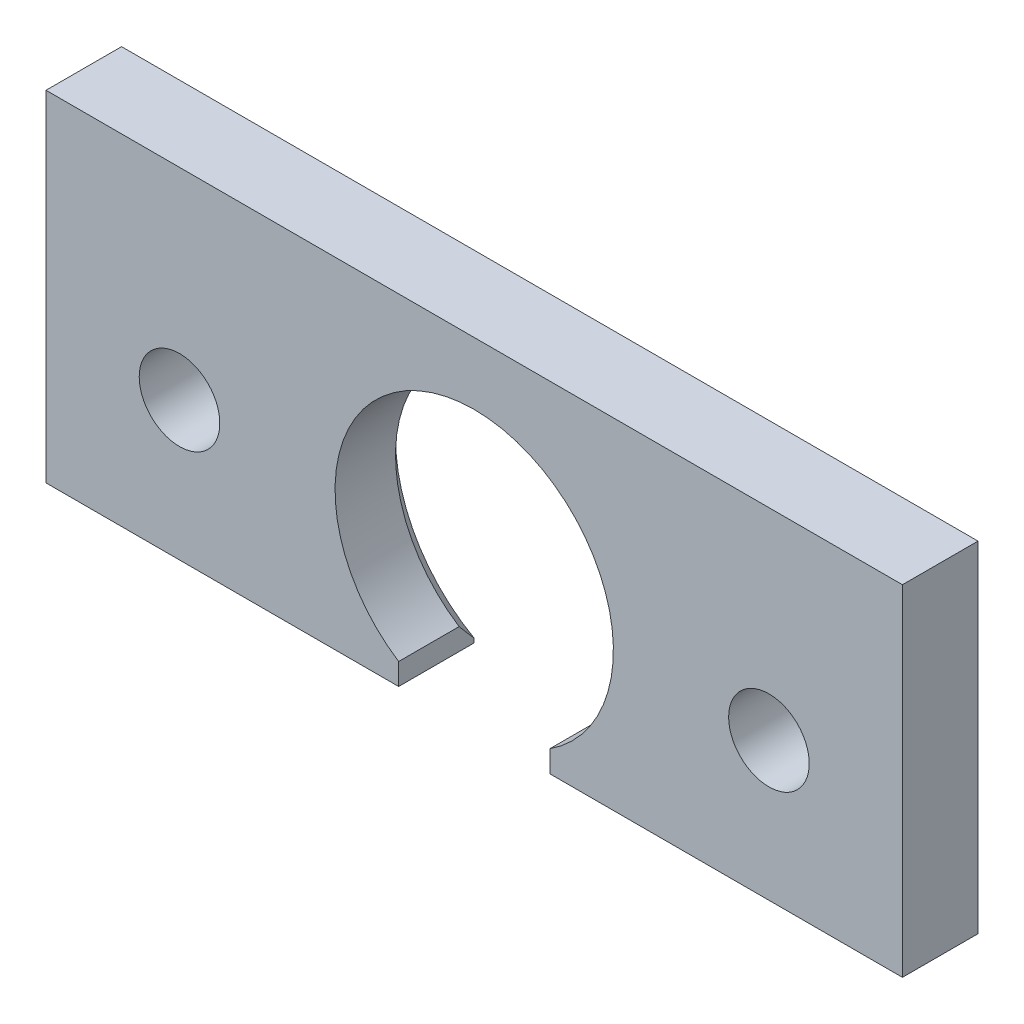
ISO-10303-21;
HEADER;
FILE_DESCRIPTION(('STEP AP214'),'2;1');
FILE_NAME('part.step','',(''),(''),'','','');
FILE_SCHEMA(('AUTOMOTIVE_DESIGN { 1 0 10303 214 1 1 1 1 }'));
ENDSEC;
DATA;
#1=APPLICATION_CONTEXT('core data for automotive mechanical design processes');
#2=APPLICATION_PROTOCOL_DEFINITION('international standard','automotive_design',2000,#1);
#3=PRODUCT_CONTEXT('',#1,'mechanical');
#4=PRODUCT('Part','Part','',(#3));
#5=PRODUCT_RELATED_PRODUCT_CATEGORY('part','',(#4));
#6=PRODUCT_DEFINITION_FORMATION('','',#4);
#7=PRODUCT_DEFINITION_CONTEXT('part definition',#1,'design');
#8=PRODUCT_DEFINITION('design','',#6,#7);
#9=PRODUCT_DEFINITION_SHAPE('','',#8);
#10=(LENGTH_UNIT() NAMED_UNIT(*) SI_UNIT(.MILLI.,.METRE.));
#11=(NAMED_UNIT(*) PLANE_ANGLE_UNIT() SI_UNIT($,.RADIAN.));
#12=(NAMED_UNIT(*) SI_UNIT($,.STERADIAN.) SOLID_ANGLE_UNIT());
#13=UNCERTAINTY_MEASURE_WITH_UNIT(LENGTH_MEASURE(1.E-05),#10,'distance_accuracy_value','');
#14=(GEOMETRIC_REPRESENTATION_CONTEXT(3) GLOBAL_UNCERTAINTY_ASSIGNED_CONTEXT((#13)) GLOBAL_UNIT_ASSIGNED_CONTEXT((#10,
#11,#12)) REPRESENTATION_CONTEXT('',''));
#15=CARTESIAN_POINT('',(0.,0.,0.));
#16=DIRECTION('',(0.,0.,1.));
#17=DIRECTION('',(1.,0.,0.));
#18=AXIS2_PLACEMENT_3D('',#15,#16,#17);
#19=CARTESIAN_POINT('',(-85.,40.0000000000002,14.9999999999989));
#20=DIRECTION('',(0.,0.999999999999998,0.));
#21=DIRECTION('',(0.,0.,1.00000000000002));
#22=AXIS2_PLACEMENT_3D('',#19,#20,#21);
#23=PLANE('',#22);
#24=DIRECTION('',(0.999999999999998,0.,0.));
#25=VECTOR('',#24,1.);
#26=CARTESIAN_POINT('',(-84.9999999999998,40.0000000000004,1.11022302462516E-12));
#27=LINE('',#26,#25);
#28=CARTESIAN_POINT('',(-84.9999999999998,40.0000000000004,1.11022302462516E-12));
#29=VERTEX_POINT('',#28);
#30=CARTESIAN_POINT('',(84.9999999999997,40.0000000000003,-3.33066907387547E-13));
#31=VERTEX_POINT('',#30);
#32=EDGE_CURVE('E134',#29,#31,#27,.T.);
#33=ORIENTED_EDGE('',*,*,#32,.F.);
#34=DIRECTION('',(0.,0.,-1.00000000000002));
#35=VECTOR('',#34,1.);
#36=CARTESIAN_POINT('',(-85.,40.0000000000002,14.9999999999989));
#37=LINE('',#36,#35);
#38=CARTESIAN_POINT('',(-85.,40.0000000000002,14.9999999999989));
#39=VERTEX_POINT('',#38);
#40=EDGE_CURVE('E202',#39,#29,#37,.T.);
#41=ORIENTED_EDGE('',*,*,#40,.F.);
#42=DIRECTION('',(0.999999999999998,0.,0.));
#43=VECTOR('',#42,1.);
#44=CARTESIAN_POINT('',(-85.,40.0000000000002,14.9999999999989));
#45=LINE('',#44,#43);
#46=CARTESIAN_POINT('',(84.9999999999999,40.,15.0000000000005));
#47=VERTEX_POINT('',#46);
#48=EDGE_CURVE('E144',#39,#47,#45,.T.);
#49=ORIENTED_EDGE('',*,*,#48,.T.);
#50=DIRECTION('',(0.,0.,-1.00000000000002));
#51=VECTOR('',#50,1.);
#52=CARTESIAN_POINT('',(84.9999999999999,40.,15.0000000000005));
#53=LINE('',#52,#51);
#54=EDGE_CURVE('E127',#47,#31,#53,.T.);
#55=ORIENTED_EDGE('',*,*,#54,.T.);
#56=EDGE_LOOP('',(#33,#41,#49,#55));
#57=FACE_BOUND('',#56,.T.);
#58=ADVANCED_FACE('F46',(#57),#23,.T.);
#59=CARTESIAN_POINT('',(-85.0000000000002,27.5000000000001,14.9999999999995));
#60=DIRECTION('',(-0.999999999999998,0.,0.));
#61=DIRECTION('',(0.,0.,1.00000000000002));
#62=AXIS2_PLACEMENT_3D('',#59,#60,#61);
#63=PLANE('',#62);
#64=DIRECTION('',(0.,0.999999999999998,0.));
#65=VECTOR('',#64,1.);
#66=CARTESIAN_POINT('',(-84.9999999999997,27.5000000000004,1.11022302462516E-12));
#67=LINE('',#66,#65);
#68=CARTESIAN_POINT('',(-85.,-27.4999999999998,1.22124532708767E-12));
#69=VERTEX_POINT('',#68);
#70=EDGE_CURVE('E192',#69,#29,#67,.T.);
#71=ORIENTED_EDGE('',*,*,#70,.F.);
#72=DIRECTION('',(0.,0.,-1.00000000000002));
#73=VECTOR('',#72,1.);
#74=CARTESIAN_POINT('',(-84.9999999999999,-27.4999999999996,14.9999999999985));
#75=LINE('',#74,#73);
#76=CARTESIAN_POINT('',(-84.9999999999999,-27.4999999999996,14.9999999999985));
#77=VERTEX_POINT('',#76);
#78=EDGE_CURVE('E205',#77,#69,#75,.T.);
#79=ORIENTED_EDGE('',*,*,#78,.F.);
#80=DIRECTION('',(0.,0.999999999999998,0.));
#81=VECTOR('',#80,1.);
#82=CARTESIAN_POINT('',(-85.0000000000002,27.5000000000001,14.9999999999995));
#83=LINE('',#82,#81);
#84=EDGE_CURVE('E170',#77,#39,#83,.T.);
#85=ORIENTED_EDGE('',*,*,#84,.T.);
#86=ORIENTED_EDGE('',*,*,#40,.T.);
#87=EDGE_LOOP('',(#71,#79,#85,#86));
#88=FACE_BOUND('',#87,.T.);
#89=ADVANCED_FACE('F253',(#88),#63,.T.);
#90=CARTESIAN_POINT('',(-14.9999999999998,-27.4999999999993,15.0000000000023));
#91=DIRECTION('',(0.,-0.999999999999999,0.));
#92=DIRECTION('',(0.999999999999998,0.,0.));
#93=AXIS2_PLACEMENT_3D('',#90,#91,#92);
#94=PLANE('',#93);
#95=DIRECTION('',(-0.999999999999998,0.,0.));
#96=VECTOR('',#95,1.);
#97=CARTESIAN_POINT('',(-15.,-27.4999999999989,3.33066907387547E-13));
#98=LINE('',#97,#96);
#99=CARTESIAN_POINT('',(-15.,-27.4999999999989,3.33066907387547E-13));
#100=VERTEX_POINT('',#99);
#101=EDGE_CURVE('E188',#100,#69,#98,.T.);
#102=ORIENTED_EDGE('',*,*,#101,.F.);
#103=DIRECTION('',(0.,0.,-1.00000000000002));
#104=VECTOR('',#103,1.);
#105=CARTESIAN_POINT('',(-14.9999999999998,-27.4999999999993,15.0000000000023));
#106=LINE('',#105,#104);
#107=CARTESIAN_POINT('',(-14.9999999999998,-27.4999999999993,15.0000000000023));
#108=VERTEX_POINT('',#107);
#109=EDGE_CURVE('E209',#108,#100,#106,.T.);
#110=ORIENTED_EDGE('',*,*,#109,.F.);
#111=DIRECTION('',(-0.999999999999998,0.,0.));
#112=VECTOR('',#111,1.);
#113=CARTESIAN_POINT('',(-14.9999999999998,-27.4999999999993,15.0000000000023));
#114=LINE('',#113,#112);
#115=EDGE_CURVE('E166',#108,#77,#114,.T.);
#116=ORIENTED_EDGE('',*,*,#115,.T.);
#117=ORIENTED_EDGE('',*,*,#78,.T.);
#118=EDGE_LOOP('',(#102,#110,#116,#117));
#119=FACE_BOUND('',#118,.T.);
#120=ADVANCED_FACE('F236',(#119),#94,.T.);
#121=CARTESIAN_POINT('',(-14.9999999999999,-23.1978581985487,15.0000000000018));
#122=DIRECTION('',(0.999999999999998,0.,0.));
#123=DIRECTION('',(0.,0.,-1.00000000000002));
#124=AXIS2_PLACEMENT_3D('',#121,#122,#123);
#125=PLANE('',#124);
#126=DIRECTION('',(0.,-0.999999999999998,0.));
#127=VECTOR('',#126,1.);
#128=CARTESIAN_POINT('',(-14.9999999999998,-23.1978581985485,5.55111512312578E-13));
#129=LINE('',#128,#127);
#130=CARTESIAN_POINT('',(-15.0000000000001,-26.7000117041166,7.7715611723761E-13));
#131=VERTEX_POINT('',#130);
#132=EDGE_CURVE('E185',#131,#100,#129,.T.);
#133=ORIENTED_EDGE('',*,*,#132,.F.);
#134=CARTESIAN_POINT('',(-15.0000000000001,-26.7000117041166,7.7715611723761E-13));
#135=CARTESIAN_POINT('',(-15.,-26.4103468358162,0.252537156596025));
#136=CARTESIAN_POINT('',(-14.9999999999999,-26.120196547771,0.504518436839914));
#137=CARTESIAN_POINT('',(-14.9999999999999,-25.5388424364599,1.00725001289121));
#138=CARTESIAN_POINT('',(-14.9999999999999,-25.247638635797,1.25800033483994));
#139=CARTESIAN_POINT('',(-14.9999999999999,-24.6640815369736,1.75816233148518));
#140=CARTESIAN_POINT('',(-14.9999999999999,-24.3717282352016,2.00757400196996));
#141=CARTESIAN_POINT('',(-14.9999999999999,-23.785762308893,2.50492609294541));
#142=CARTESIAN_POINT('',(-14.9999999999999,-23.4921496576188,2.7528664819299));
#143=CARTESIAN_POINT('',(-15.,-23.1978581985486,3.00000000000011));
#144=B_SPLINE_CURVE_WITH_KNOTS('',3,(#134,#135,#136,#137,#138,#139,#140,#141,#142,#143),
.UNSPECIFIED.,.F.,.F.,(4,2,2,2,4),(0.,1.15287774819484,2.30573090638448,3.45858768960279,
4.61146907176898),.UNSPECIFIED.);
#145=CARTESIAN_POINT('',(-15.,-23.1978581985486,3.00000000000011));
#146=VERTEX_POINT('',#145);
#147=EDGE_CURVE('E75',#131,#146,#144,.T.);
#148=ORIENTED_EDGE('',*,*,#147,.T.);
#149=DIRECTION('',(0.,0.,-1.00000000000002));
#150=VECTOR('',#149,1.);
#151=CARTESIAN_POINT('',(-14.9999999999999,-23.1978581985487,15.0000000000018));
#152=LINE('',#151,#150);
#153=CARTESIAN_POINT('',(-14.9999999999999,-23.1978581985487,15.0000000000018));
#154=VERTEX_POINT('',#153);
#155=EDGE_CURVE('E213',#154,#146,#152,.T.);
#156=ORIENTED_EDGE('',*,*,#155,.F.);
#157=DIRECTION('',(0.,-0.999999999999998,0.));
#158=VECTOR('',#157,1.);
#159=CARTESIAN_POINT('',(-14.9999999999999,-23.1978581985487,15.0000000000018));
#160=LINE('',#159,#158);
#161=EDGE_CURVE('E162',#154,#108,#160,.T.);
#162=ORIENTED_EDGE('',*,*,#161,.T.);
#163=ORIENTED_EDGE('',*,*,#109,.T.);
#164=EDGE_LOOP('',(#133,#148,#156,#162,#163));
#165=FACE_BOUND('',#164,.T.);
#166=ADVANCED_FACE('F230',(#165),#125,.T.);
#167=CARTESIAN_POINT('',(1.11022302462516E-13,4.44089209850063E-13,14.9999999999999));
#168=DIRECTION('',(0.,0.,-1.00000000000002));
#169=DIRECTION('',(-0.999999999999998,0.,0.));
#170=AXIS2_PLACEMENT_3D('',#167,#168,#169);
#171=CYLINDRICAL_SURFACE('',#170,27.625);
#172=ORIENTED_EDGE('',*,*,#155,.T.);
#173=CARTESIAN_POINT('',(0.,0.,2.99999999999989));
#174=DIRECTION('',(0.,0.,-1.00000000000002));
#175=DIRECTION('',(-0.999999999999998,0.,0.));
#176=AXIS2_PLACEMENT_3D('',#173,#174,#175);
#177=CIRCLE('',#176,27.625);
#178=CARTESIAN_POINT('',(14.9999999999999,-23.1978581985488,2.99999999999812));
#179=VERTEX_POINT('',#178);
#180=EDGE_CURVE('E61',#146,#179,#177,.T.);
#181=ORIENTED_EDGE('',*,*,#180,.T.);
#182=DIRECTION('',(0.,0.,-1.00000000000002));
#183=VECTOR('',#182,1.);
#184=CARTESIAN_POINT('',(15.0000000000002,-23.1978581985486,15.0000000000002));
#185=LINE('',#184,#183);
#186=CARTESIAN_POINT('',(15.0000000000002,-23.1978581985486,15.0000000000002));
#187=VERTEX_POINT('',#186);
#188=EDGE_CURVE('E216',#187,#179,#185,.T.);
#189=ORIENTED_EDGE('',*,*,#188,.F.);
#190=CARTESIAN_POINT('',(1.11022302462516E-13,4.44089209850063E-13,14.9999999999999));
#191=DIRECTION('',(0.,0.,1.00000000000002));
#192=DIRECTION('',(-0.999999999999998,0.,0.));
#193=AXIS2_PLACEMENT_3D('',#190,#191,#192);
#194=CIRCLE('',#193,27.625);
#195=EDGE_CURVE('E155',#187,#154,#194,.T.);
#196=ORIENTED_EDGE('',*,*,#195,.T.);
#197=EDGE_LOOP('',(#172,#181,#189,#196));
#198=FACE_BOUND('',#197,.T.);
#199=ADVANCED_FACE('F235',(#198),#171,.F.);
#200=CARTESIAN_POINT('',(15.0000000000002,-23.1978581985486,15.0000000000002));
#201=DIRECTION('',(-0.999999999999998,0.,0.));
#202=DIRECTION('',(0.,0.,1.00000000000002));
#203=AXIS2_PLACEMENT_3D('',#200,#201,#202);
#204=PLANE('',#203);
#205=ORIENTED_EDGE('',*,*,#188,.T.);
#206=CARTESIAN_POINT('',(14.9999999999999,-23.1978581985488,2.99999999999812));
#207=CARTESIAN_POINT('',(15.0000000000001,-23.4921496576195,2.75286648192854));
#208=CARTESIAN_POINT('',(15.0000000000002,-23.785762308894,2.50492609294425));
#209=CARTESIAN_POINT('',(15.0000000000003,-24.3717282352028,2.00757400196888));
#210=CARTESIAN_POINT('',(15.0000000000002,-24.6640815369748,1.75816233148398));
#211=CARTESIAN_POINT('',(15.0000000000002,-25.2476386357982,1.25800033483872));
#212=CARTESIAN_POINT('',(15.0000000000003,-25.5388424364613,1.00725001289009));
#213=CARTESIAN_POINT('',(15.0000000000002,-26.1201965477722,0.504518436838422));
#214=CARTESIAN_POINT('',(15.0000000000001,-26.410346835817,0.252537156594064));
#215=CARTESIAN_POINT('',(14.9999999999998,-26.7000117041165,-2.33146835171283E-12));
#216=B_SPLINE_CURVE_WITH_KNOTS('',3,(#206,#207,#208,#209,#210,#211,#212,#213,#214,#215),
.UNSPECIFIED.,.F.,.F.,(4,2,2,2,4),(0.,1.15288138216634,2.30573816538479,3.45859132357457,
4.61146907176956),.UNSPECIFIED.);
#217=CARTESIAN_POINT('',(14.9999999999998,-26.7000117041165,-2.33146835171283E-12));
#218=VERTEX_POINT('',#217);
#219=EDGE_CURVE('E11',#179,#218,#216,.T.);
#220=ORIENTED_EDGE('',*,*,#219,.T.);
#221=DIRECTION('',(0.,0.999999999999998,0.));
#222=VECTOR('',#221,1.);
#223=CARTESIAN_POINT('',(15.,-23.1978581985486,-2.44249065417534E-12));
#224=LINE('',#223,#222);
#225=CARTESIAN_POINT('',(15.,-27.4999999999994,-2.55351295663786E-12));
#226=VERTEX_POINT('',#225);
#227=EDGE_CURVE('E181',#226,#218,#224,.T.);
#228=ORIENTED_EDGE('',*,*,#227,.F.);
#229=DIRECTION('',(0.,0.,-1.00000000000002));
#230=VECTOR('',#229,1.);
#231=CARTESIAN_POINT('',(15.0000000000002,-27.4999999999993,15.0000000000002));
#232=LINE('',#231,#230);
#233=CARTESIAN_POINT('',(15.0000000000002,-27.4999999999993,15.0000000000002));
#234=VERTEX_POINT('',#233);
#235=EDGE_CURVE('E143',#234,#226,#232,.T.);
#236=ORIENTED_EDGE('',*,*,#235,.F.);
#237=DIRECTION('',(0.,0.999999999999998,0.));
#238=VECTOR('',#237,1.);
#239=CARTESIAN_POINT('',(15.0000000000002,-23.1978581985486,15.0000000000002));
#240=LINE('',#239,#238);
#241=EDGE_CURVE('E150',#234,#187,#240,.T.);
#242=ORIENTED_EDGE('',*,*,#241,.T.);
#243=EDGE_LOOP('',(#205,#220,#228,#236,#242));
#244=FACE_BOUND('',#243,.T.);
#245=ADVANCED_FACE('F239',(#244),#204,.T.);
#246=CARTESIAN_POINT('',(15.0000000000002,-27.4999999999993,15.0000000000002));
#247=DIRECTION('',(0.,-0.999999999999999,0.));
#248=DIRECTION('',(0.999999999999998,0.,0.));
#249=AXIS2_PLACEMENT_3D('',#246,#247,#248);
#250=PLANE('',#249);
#251=DIRECTION('',(-0.999999999999998,0.,0.));
#252=VECTOR('',#251,1.);
#253=CARTESIAN_POINT('',(15.,-27.4999999999994,-2.55351295663786E-12));
#254=LINE('',#253,#252);
#255=CARTESIAN_POINT('',(84.9999999999996,-27.4999999999996,-1.11022302462516E-13));
#256=VERTEX_POINT('',#255);
#257=EDGE_CURVE('E140',#256,#226,#254,.T.);
#258=ORIENTED_EDGE('',*,*,#257,.F.);
#259=DIRECTION('',(0.,0.,-1.00000000000002));
#260=VECTOR('',#259,1.);
#261=CARTESIAN_POINT('',(84.9999999999996,-27.5,14.9999999999998));
#262=LINE('',#261,#260);
#263=CARTESIAN_POINT('',(84.9999999999996,-27.5,14.9999999999998));
#264=VERTEX_POINT('',#263);
#265=EDGE_CURVE('E124',#264,#256,#262,.T.);
#266=ORIENTED_EDGE('',*,*,#265,.F.);
#267=DIRECTION('',(-0.999999999999998,0.,0.));
#268=VECTOR('',#267,1.);
#269=CARTESIAN_POINT('',(15.0000000000002,-27.4999999999993,15.0000000000002));
#270=LINE('',#269,#268);
#271=EDGE_CURVE('E133',#264,#234,#270,.T.);
#272=ORIENTED_EDGE('',*,*,#271,.T.);
#273=ORIENTED_EDGE('',*,*,#235,.T.);
#274=EDGE_LOOP('',(#258,#266,#272,#273));
#275=FACE_BOUND('',#274,.T.);
#276=ADVANCED_FACE('F138',(#275),#250,.T.);
#277=CARTESIAN_POINT('',(84.9999999999999,27.5000000000001,15.0000000000002));
#278=DIRECTION('',(0.999999999999998,0.,0.));
#279=DIRECTION('',(0.,0.,-1.00000000000002));
#280=AXIS2_PLACEMENT_3D('',#277,#278,#279);
#281=PLANE('',#280);
#282=DIRECTION('',(0.,-0.999999999999998,0.));
#283=VECTOR('',#282,1.);
#284=CARTESIAN_POINT('',(85.,27.5000000000005,-5.55111512312578E-13));
#285=LINE('',#284,#283);
#286=EDGE_CURVE('E175',#31,#256,#285,.T.);
#287=ORIENTED_EDGE('',*,*,#286,.F.);
#288=ORIENTED_EDGE('',*,*,#54,.F.);
#289=DIRECTION('',(0.,-0.999999999999998,0.));
#290=VECTOR('',#289,1.);
#291=CARTESIAN_POINT('',(84.9999999999999,40.,15.0000000000005));
#292=LINE('',#291,#290);
#293=EDGE_CURVE('E121',#47,#264,#292,.T.);
#294=ORIENTED_EDGE('',*,*,#293,.T.);
#295=ORIENTED_EDGE('',*,*,#265,.T.);
#296=EDGE_LOOP('',(#287,#288,#294,#295));
#297=FACE_BOUND('',#296,.T.);
#298=ADVANCED_FACE('F123',(#297),#281,.T.);
#299=CARTESIAN_POINT('',(1.11022302462516E-13,4.44089209850063E-13,14.9999999999999));
#300=DIRECTION('',(0.,0.,-1.00000000000002));
#301=DIRECTION('',(-0.999999999999998,0.,0.));
#302=AXIS2_PLACEMENT_3D('',#299,#300,#301);
#303=PLANE('',#302);
#304=CARTESIAN_POINT('',(-58.5000000000001,4.57966997657877E-13,14.9999999999992));
#305=DIRECTION('',(0.,0.,-1.00000000000002));
#306=DIRECTION('',(-0.999999999999998,0.,0.));
#307=AXIS2_PLACEMENT_3D('',#304,#305,#306);
#308=CIRCLE('',#307,8.);
#309=CARTESIAN_POINT('',(-66.5000000000001,4.58411086867727E-13,14.9999999999992));
#310=VERTEX_POINT('',#309);
#311=EDGE_CURVE('E279',#310,#310,#308,.T.);
#312=ORIENTED_EDGE('',*,*,#311,.T.);
#313=EDGE_LOOP('',(#312));
#314=FACE_BOUND('',#313,.T.);
#315=CARTESIAN_POINT('',(58.4999999999998,5.759281940243E-13,15.0000000000001));
#316=DIRECTION('',(0.,0.,-1.00000000000002));
#317=DIRECTION('',(-0.999999999999998,0.,0.));
#318=AXIS2_PLACEMENT_3D('',#315,#316,#317);
#319=CIRCLE('',#318,8.);
#320=CARTESIAN_POINT('',(50.4999999999998,5.7637228323415E-13,15.0000000000001));
#321=VERTEX_POINT('',#320);
#322=EDGE_CURVE('E178',#321,#321,#319,.T.);
#323=ORIENTED_EDGE('',*,*,#322,.T.);
#324=EDGE_LOOP('',(#323));
#325=FACE_BOUND('',#324,.T.);
#326=ORIENTED_EDGE('',*,*,#293,.F.);
#327=ORIENTED_EDGE('',*,*,#48,.F.);
#328=ORIENTED_EDGE('',*,*,#84,.F.);
#329=ORIENTED_EDGE('',*,*,#115,.F.);
#330=ORIENTED_EDGE('',*,*,#161,.F.);
#331=ORIENTED_EDGE('',*,*,#195,.F.);
#332=ORIENTED_EDGE('',*,*,#241,.F.);
#333=ORIENTED_EDGE('',*,*,#271,.F.);
#334=EDGE_LOOP('',(#326,#327,#328,#329,#330,#331,#332,#333));
#335=FACE_BOUND('',#334,.T.);
#336=ADVANCED_FACE('F147',(#314,#325,#335),#303,.F.);
#337=CARTESIAN_POINT('',(0.,0.,0.));
#338=DIRECTION('',(0.,0.,-1.00000000000002));
#339=DIRECTION('',(-0.999999999999998,0.,0.));
#340=AXIS2_PLACEMENT_3D('',#337,#338,#339);
#341=PLANE('',#340);
#342=CARTESIAN_POINT('',(-58.4999999999998,2.35922392732846E-13,-4.44089209850063E-13));
#343=DIRECTION('',(0.,0.,-1.00000000000002));
#344=DIRECTION('',(-0.999999999999998,0.,0.));
#345=AXIS2_PLACEMENT_3D('',#342,#343,#344);
#346=CIRCLE('',#345,8.);
#347=CARTESIAN_POINT('',(-66.4999999999998,2.36366481942696E-13,-4.43867165245361E-13));
#348=VERTEX_POINT('',#347);
#349=EDGE_CURVE('E282',#348,#348,#346,.T.);
#350=ORIENTED_EDGE('',*,*,#349,.F.);
#351=EDGE_LOOP('',(#350));
#352=FACE_BOUND('',#351,.T.);
#353=CARTESIAN_POINT('',(58.4999999999999,5.20417042793042E-13,1.11022302462516E-13));
#354=DIRECTION('',(0.,0.,-1.00000000000002));
#355=DIRECTION('',(-0.999999999999998,0.,0.));
#356=AXIS2_PLACEMENT_3D('',#353,#354,#355);
#357=CIRCLE('',#356,8.);
#358=CARTESIAN_POINT('',(50.4999999999999,5.20861132002892E-13,1.11244347067217E-13));
#359=VERTEX_POINT('',#358);
#360=EDGE_CURVE('E287',#359,#359,#357,.T.);
#361=ORIENTED_EDGE('',*,*,#360,.F.);
#362=EDGE_LOOP('',(#361));
#363=FACE_BOUND('',#362,.T.);
#364=ORIENTED_EDGE('',*,*,#227,.T.);
#365=CARTESIAN_POINT('',(0.,0.,0.));
#366=DIRECTION('',(0.,0.,-1.00000000000002));
#367=DIRECTION('',(-0.999999999999998,0.,0.));
#368=AXIS2_PLACEMENT_3D('',#365,#366,#367);
#369=CIRCLE('',#368,30.625);
#370=EDGE_CURVE('E201',#218,#131,#369,.F.);
#371=ORIENTED_EDGE('',*,*,#370,.T.);
#372=ORIENTED_EDGE('',*,*,#132,.T.);
#373=ORIENTED_EDGE('',*,*,#101,.T.);
#374=ORIENTED_EDGE('',*,*,#70,.T.);
#375=ORIENTED_EDGE('',*,*,#32,.T.);
#376=ORIENTED_EDGE('',*,*,#286,.T.);
#377=ORIENTED_EDGE('',*,*,#257,.T.);
#378=EDGE_LOOP('',(#364,#371,#372,#373,#374,#375,#376,#377));
#379=FACE_BOUND('',#378,.T.);
#380=ADVANCED_FACE('F249',(#352,#363,#379),#341,.T.);
#381=CARTESIAN_POINT('',(58.4999999999999,5.20417042793042E-13,1.11022302462516E-13));
#382=DIRECTION('',(0.,0.,-1.00000000000002));
#383=DIRECTION('',(-0.999999999999998,0.,0.));
#384=AXIS2_PLACEMENT_3D('',#381,#382,#383);
#385=CYLINDRICAL_SURFACE('',#384,8.);
#386=ORIENTED_EDGE('',*,*,#322,.F.);
#387=EDGE_LOOP('',(#386));
#388=FACE_BOUND('',#387,.T.);
#389=ORIENTED_EDGE('',*,*,#360,.T.);
#390=EDGE_LOOP('',(#389));
#391=FACE_BOUND('',#390,.T.);
#392=ADVANCED_FACE('F263',(#388,#391),#385,.F.);
#393=CARTESIAN_POINT('',(-58.4999999999998,2.35922392732846E-13,-4.44089209850063E-13));
#394=DIRECTION('',(0.,0.,-1.00000000000002));
#395=DIRECTION('',(-0.999999999999998,0.,0.));
#396=AXIS2_PLACEMENT_3D('',#393,#394,#395);
#397=CYLINDRICAL_SURFACE('',#396,8.);
#398=ORIENTED_EDGE('',*,*,#311,.F.);
#399=EDGE_LOOP('',(#398));
#400=FACE_BOUND('',#399,.T.);
#401=ORIENTED_EDGE('',*,*,#349,.T.);
#402=EDGE_LOOP('',(#401));
#403=FACE_BOUND('',#402,.T.);
#404=ADVANCED_FACE('F268',(#400,#403),#397,.F.);
#405=CARTESIAN_POINT('',(0.,0.,0.));
#406=DIRECTION('',(0.,0.,-1.00000000000002));
#407=DIRECTION('',(-0.999999999999998,0.,0.));
#408=AXIS2_PLACEMENT_3D('',#405,#406,#407);
#409=CONICAL_SURFACE('',#408,30.625,0.785398163397448);
#410=ORIENTED_EDGE('',*,*,#219,.F.);
#411=ORIENTED_EDGE('',*,*,#180,.F.);
#412=ORIENTED_EDGE('',*,*,#147,.F.);
#413=ORIENTED_EDGE('',*,*,#370,.F.);
#414=EDGE_LOOP('',(#410,#411,#412,#413));
#415=FACE_BOUND('',#414,.T.);
#416=ADVANCED_FACE('F48',(#415),#409,.F.);
#417=CLOSED_SHELL('',(#58,#89,#120,#166,#199,#245,#276,#298,#336,#380,#392,#404,#416));
#418=MANIFOLD_SOLID_BREP('B2',#417);
#419=ADVANCED_BREP_SHAPE_REPRESENTATION('',(#18,#418),#14);
#420=SHAPE_DEFINITION_REPRESENTATION(#9,#419);
ENDSEC;
END-ISO-10303-21;
